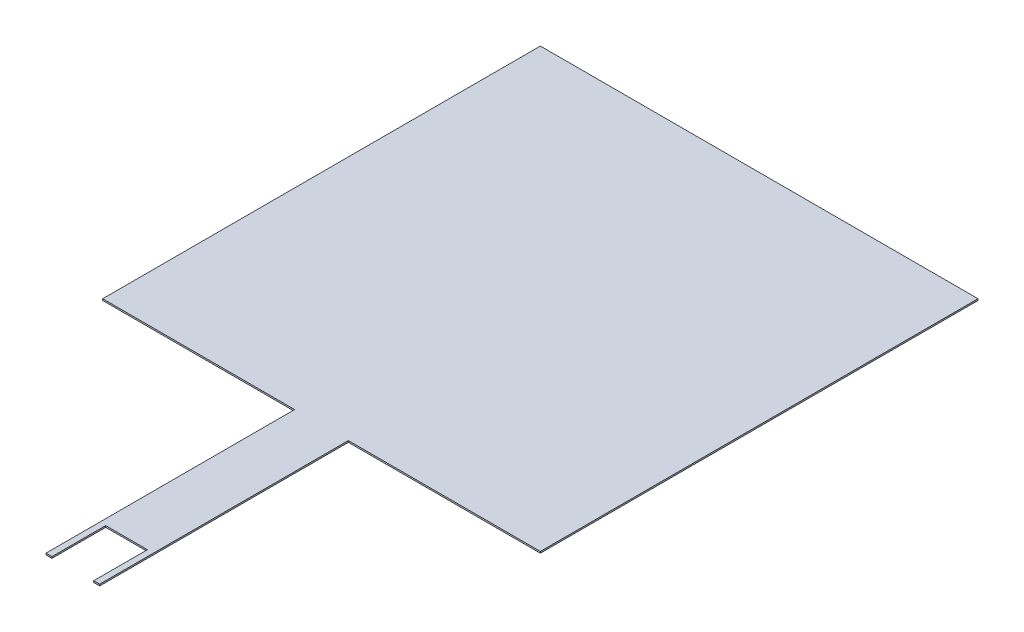
ISO-10303-21;
HEADER;
FILE_DESCRIPTION(('STEP AP214'),'2;1');
FILE_NAME('part.step','',(''),(''),'','','');
FILE_SCHEMA(('AUTOMOTIVE_DESIGN { 1 0 10303 214 1 1 1 1 }'));
ENDSEC;
DATA;
#1=APPLICATION_CONTEXT('core data for automotive mechanical design processes');
#2=APPLICATION_PROTOCOL_DEFINITION('international standard','automotive_design',2000,#1);
#3=PRODUCT_CONTEXT('',#1,'mechanical');
#4=PRODUCT('Part','Part','',(#3));
#5=PRODUCT_RELATED_PRODUCT_CATEGORY('part','',(#4));
#6=PRODUCT_DEFINITION_FORMATION('','',#4);
#7=PRODUCT_DEFINITION_CONTEXT('part definition',#1,'design');
#8=PRODUCT_DEFINITION('design','',#6,#7);
#9=PRODUCT_DEFINITION_SHAPE('','',#8);
#10=(LENGTH_UNIT() NAMED_UNIT(*) SI_UNIT(.MILLI.,.METRE.));
#11=(NAMED_UNIT(*) PLANE_ANGLE_UNIT() SI_UNIT($,.RADIAN.));
#12=(NAMED_UNIT(*) SI_UNIT($,.STERADIAN.) SOLID_ANGLE_UNIT());
#13=UNCERTAINTY_MEASURE_WITH_UNIT(LENGTH_MEASURE(1.E-05),#10,'distance_accuracy_value','');
#14=(GEOMETRIC_REPRESENTATION_CONTEXT(3) GLOBAL_UNCERTAINTY_ASSIGNED_CONTEXT((#13)) GLOBAL_UNIT_ASSIGNED_CONTEXT((#10,
#11,#12)) REPRESENTATION_CONTEXT('',''));
#15=CARTESIAN_POINT('',(0.,0.,0.));
#16=DIRECTION('',(0.,0.,1.));
#17=DIRECTION('',(1.,0.,0.));
#18=AXIS2_PLACEMENT_3D('',#15,#16,#17);
#19=CARTESIAN_POINT('',(27.94,0.2032,27.94));
#20=DIRECTION('',(-1.,0.,0.));
#21=DIRECTION('',(0.,0.,1.));
#22=AXIS2_PLACEMENT_3D('',#19,#20,#21);
#23=PLANE('',#22);
#24=DIRECTION('',(0.,0.,-1.));
#25=VECTOR('',#24,1.);
#26=CARTESIAN_POINT('',(27.94,0.,27.94));
#27=LINE('',#26,#25);
#28=CARTESIAN_POINT('',(27.94,0.,27.94));
#29=VERTEX_POINT('',#28);
#30=CARTESIAN_POINT('',(27.94,0.,-27.94));
#31=VERTEX_POINT('',#30);
#32=EDGE_CURVE('E165',#29,#31,#27,.T.);
#33=ORIENTED_EDGE('',*,*,#32,.T.);
#34=DIRECTION('',(0.,-1.,0.));
#35=VECTOR('',#34,1.);
#36=CARTESIAN_POINT('',(27.94,0.2032,-27.94));
#37=LINE('',#36,#35);
#38=CARTESIAN_POINT('',(27.94,0.2032,-27.94));
#39=VERTEX_POINT('',#38);
#40=EDGE_CURVE('E11',#39,#31,#37,.T.);
#41=ORIENTED_EDGE('',*,*,#40,.F.);
#42=DIRECTION('',(0.,0.,-1.));
#43=VECTOR('',#42,1.);
#44=CARTESIAN_POINT('',(27.94,0.2032,27.94));
#45=LINE('',#44,#43);
#46=CARTESIAN_POINT('',(27.94,0.2032,27.94));
#47=VERTEX_POINT('',#46);
#48=EDGE_CURVE('E188',#47,#39,#45,.T.);
#49=ORIENTED_EDGE('',*,*,#48,.F.);
#50=DIRECTION('',(0.,-1.,0.));
#51=VECTOR('',#50,1.);
#52=CARTESIAN_POINT('',(27.94,0.2032,27.94));
#53=LINE('',#52,#51);
#54=EDGE_CURVE('E161',#47,#29,#53,.T.);
#55=ORIENTED_EDGE('',*,*,#54,.T.);
#56=EDGE_LOOP('',(#33,#41,#49,#55));
#57=FACE_BOUND('',#56,.T.);
#58=ADVANCED_FACE('F45',(#57),#23,.F.);
#59=CARTESIAN_POINT('',(-27.94,0.2032,-27.94));
#60=DIRECTION('',(0.,0.,1.));
#61=DIRECTION('',(1.,0.,0.));
#62=AXIS2_PLACEMENT_3D('',#59,#60,#61);
#63=PLANE('',#62);
#64=DIRECTION('',(-1.,0.,0.));
#65=VECTOR('',#64,1.);
#66=CARTESIAN_POINT('',(-27.94,0.,-27.94));
#67=LINE('',#66,#65);
#68=CARTESIAN_POINT('',(-27.94,0.,-27.94));
#69=VERTEX_POINT('',#68);
#70=EDGE_CURVE('E168',#31,#69,#67,.T.);
#71=ORIENTED_EDGE('',*,*,#70,.T.);
#72=DIRECTION('',(0.,-1.,0.));
#73=VECTOR('',#72,1.);
#74=CARTESIAN_POINT('',(-27.94,0.2032,-27.94));
#75=LINE('',#74,#73);
#76=CARTESIAN_POINT('',(-27.94,0.2032,-27.94));
#77=VERTEX_POINT('',#76);
#78=EDGE_CURVE('E53',#77,#69,#75,.T.);
#79=ORIENTED_EDGE('',*,*,#78,.F.);
#80=DIRECTION('',(-1.,0.,0.));
#81=VECTOR('',#80,1.);
#82=CARTESIAN_POINT('',(-27.94,0.2032,-27.94));
#83=LINE('',#82,#81);
#84=EDGE_CURVE('E115',#39,#77,#83,.T.);
#85=ORIENTED_EDGE('',*,*,#84,.F.);
#86=ORIENTED_EDGE('',*,*,#40,.T.);
#87=EDGE_LOOP('',(#71,#79,#85,#86));
#88=FACE_BOUND('',#87,.T.);
#89=ADVANCED_FACE('F265',(#88),#63,.F.);
#90=CARTESIAN_POINT('',(-27.94,0.2032,27.94));
#91=DIRECTION('',(1.,0.,0.));
#92=DIRECTION('',(0.,0.,-1.));
#93=AXIS2_PLACEMENT_3D('',#90,#91,#92);
#94=PLANE('',#93);
#95=DIRECTION('',(0.,0.,1.));
#96=VECTOR('',#95,1.);
#97=CARTESIAN_POINT('',(-27.94,0.,27.94));
#98=LINE('',#97,#96);
#99=CARTESIAN_POINT('',(-27.94,0.,27.94));
#100=VERTEX_POINT('',#99);
#101=EDGE_CURVE('E170',#69,#100,#98,.T.);
#102=ORIENTED_EDGE('',*,*,#101,.T.);
#103=DIRECTION('',(0.,-1.,0.));
#104=VECTOR('',#103,1.);
#105=CARTESIAN_POINT('',(-27.94,0.2032,27.94));
#106=LINE('',#105,#104);
#107=CARTESIAN_POINT('',(-27.94,0.2032,27.94));
#108=VERTEX_POINT('',#107);
#109=EDGE_CURVE('E207',#108,#100,#106,.T.);
#110=ORIENTED_EDGE('',*,*,#109,.F.);
#111=DIRECTION('',(0.,0.,1.));
#112=VECTOR('',#111,1.);
#113=CARTESIAN_POINT('',(-27.94,0.2032,27.94));
#114=LINE('',#113,#112);
#115=EDGE_CURVE('E215',#77,#108,#114,.T.);
#116=ORIENTED_EDGE('',*,*,#115,.F.);
#117=ORIENTED_EDGE('',*,*,#78,.T.);
#118=EDGE_LOOP('',(#102,#110,#116,#117));
#119=FACE_BOUND('',#118,.T.);
#120=ADVANCED_FACE('F213',(#119),#94,.F.);
#121=CARTESIAN_POINT('',(-27.94,0.2032,27.94));
#122=DIRECTION('',(0.,0.,-1.));
#123=DIRECTION('',(-1.,0.,0.));
#124=AXIS2_PLACEMENT_3D('',#121,#122,#123);
#125=PLANE('',#124);
#126=DIRECTION('',(1.,0.,0.));
#127=VECTOR('',#126,1.);
#128=CARTESIAN_POINT('',(-27.94,0.,27.94));
#129=LINE('',#128,#127);
#130=CARTESIAN_POINT('',(-3.429,0.,27.94));
#131=VERTEX_POINT('',#130);
#132=EDGE_CURVE('E172',#100,#131,#129,.T.);
#133=ORIENTED_EDGE('',*,*,#132,.T.);
#134=DIRECTION('',(0.,-1.,0.));
#135=VECTOR('',#134,1.);
#136=CARTESIAN_POINT('',(-3.429,0.2032,27.94));
#137=LINE('',#136,#135);
#138=CARTESIAN_POINT('',(-3.429,0.2032,27.94));
#139=VERTEX_POINT('',#138);
#140=EDGE_CURVE('E204',#139,#131,#137,.T.);
#141=ORIENTED_EDGE('',*,*,#140,.F.);
#142=DIRECTION('',(1.,0.,0.));
#143=VECTOR('',#142,1.);
#144=CARTESIAN_POINT('',(-27.94,0.2032,27.94));
#145=LINE('',#144,#143);
#146=EDGE_CURVE('E232',#108,#139,#145,.T.);
#147=ORIENTED_EDGE('',*,*,#146,.F.);
#148=ORIENTED_EDGE('',*,*,#109,.T.);
#149=EDGE_LOOP('',(#133,#141,#147,#148));
#150=FACE_BOUND('',#149,.T.);
#151=ADVANCED_FACE('F223',(#150),#125,.F.);
#152=CARTESIAN_POINT('',(-3.429,0.2032,52.832));
#153=DIRECTION('',(1.,0.,0.));
#154=DIRECTION('',(0.,0.,-1.));
#155=AXIS2_PLACEMENT_3D('',#152,#153,#154);
#156=PLANE('',#155);
#157=DIRECTION('',(0.,0.,1.));
#158=VECTOR('',#157,1.);
#159=CARTESIAN_POINT('',(-3.429,0.,52.832));
#160=LINE('',#159,#158);
#161=CARTESIAN_POINT('',(-3.429,0.,59.69));
#162=VERTEX_POINT('',#161);
#163=EDGE_CURVE('E175',#131,#162,#160,.T.);
#164=ORIENTED_EDGE('',*,*,#163,.T.);
#165=DIRECTION('',(0.,-1.,0.));
#166=VECTOR('',#165,1.);
#167=CARTESIAN_POINT('',(-3.429,0.2032,59.69));
#168=LINE('',#167,#166);
#169=CARTESIAN_POINT('',(-3.429,0.2032,59.69));
#170=VERTEX_POINT('',#169);
#171=EDGE_CURVE('E201',#170,#162,#168,.T.);
#172=ORIENTED_EDGE('',*,*,#171,.F.);
#173=DIRECTION('',(0.,0.,1.));
#174=VECTOR('',#173,1.);
#175=CARTESIAN_POINT('',(-3.429,0.2032,52.832));
#176=LINE('',#175,#174);
#177=EDGE_CURVE('E229',#139,#170,#176,.T.);
#178=ORIENTED_EDGE('',*,*,#177,.F.);
#179=ORIENTED_EDGE('',*,*,#140,.T.);
#180=EDGE_LOOP('',(#164,#172,#178,#179));
#181=FACE_BOUND('',#180,.T.);
#182=ADVANCED_FACE('F227',(#181),#156,.F.);
#183=CARTESIAN_POINT('',(-3.429,0.2032,59.69));
#184=DIRECTION('',(0.,0.,-1.));
#185=DIRECTION('',(-1.,0.,0.));
#186=AXIS2_PLACEMENT_3D('',#183,#184,#185);
#187=PLANE('',#186);
#188=DIRECTION('',(1.,0.,0.));
#189=VECTOR('',#188,1.);
#190=CARTESIAN_POINT('',(-3.429,0.,59.69));
#191=LINE('',#190,#189);
#192=CARTESIAN_POINT('',(-2.667,0.,59.69));
#193=VERTEX_POINT('',#192);
#194=EDGE_CURVE('E177',#162,#193,#191,.T.);
#195=ORIENTED_EDGE('',*,*,#194,.T.);
#196=DIRECTION('',(0.,-1.,0.));
#197=VECTOR('',#196,1.);
#198=CARTESIAN_POINT('',(-2.667,0.2032,59.69));
#199=LINE('',#198,#197);
#200=CARTESIAN_POINT('',(-2.667,0.2032,59.69));
#201=VERTEX_POINT('',#200);
#202=EDGE_CURVE('E198',#201,#193,#199,.T.);
#203=ORIENTED_EDGE('',*,*,#202,.F.);
#204=DIRECTION('',(1.,0.,0.));
#205=VECTOR('',#204,1.);
#206=CARTESIAN_POINT('',(-3.429,0.2032,59.69));
#207=LINE('',#206,#205);
#208=EDGE_CURVE('E231',#170,#201,#207,.T.);
#209=ORIENTED_EDGE('',*,*,#208,.F.);
#210=ORIENTED_EDGE('',*,*,#171,.T.);
#211=EDGE_LOOP('',(#195,#203,#209,#210));
#212=FACE_BOUND('',#211,.T.);
#213=ADVANCED_FACE('F278',(#212),#187,.F.);
#214=CARTESIAN_POINT('',(-2.667,0.2032,52.832));
#215=DIRECTION('',(-1.,0.,0.));
#216=DIRECTION('',(0.,0.,1.));
#217=AXIS2_PLACEMENT_3D('',#214,#215,#216);
#218=PLANE('',#217);
#219=DIRECTION('',(0.,0.,-1.));
#220=VECTOR('',#219,1.);
#221=CARTESIAN_POINT('',(-2.667,0.,52.832));
#222=LINE('',#221,#220);
#223=CARTESIAN_POINT('',(-2.667,0.,52.832));
#224=VERTEX_POINT('',#223);
#225=EDGE_CURVE('E179',#193,#224,#222,.T.);
#226=ORIENTED_EDGE('',*,*,#225,.T.);
#227=DIRECTION('',(0.,-1.,0.));
#228=VECTOR('',#227,1.);
#229=CARTESIAN_POINT('',(-2.667,0.2032,52.832));
#230=LINE('',#229,#228);
#231=CARTESIAN_POINT('',(-2.667,0.2032,52.832));
#232=VERTEX_POINT('',#231);
#233=EDGE_CURVE('E195',#232,#224,#230,.T.);
#234=ORIENTED_EDGE('',*,*,#233,.F.);
#235=DIRECTION('',(0.,0.,-1.));
#236=VECTOR('',#235,1.);
#237=CARTESIAN_POINT('',(-2.667,0.2032,52.832));
#238=LINE('',#237,#236);
#239=EDGE_CURVE('E234',#201,#232,#238,.T.);
#240=ORIENTED_EDGE('',*,*,#239,.F.);
#241=ORIENTED_EDGE('',*,*,#202,.T.);
#242=EDGE_LOOP('',(#226,#234,#240,#241));
#243=FACE_BOUND('',#242,.T.);
#244=ADVANCED_FACE('F281',(#243),#218,.F.);
#245=CARTESIAN_POINT('',(-2.667,0.2032,52.832));
#246=DIRECTION('',(0.,0.,-1.));
#247=DIRECTION('',(-1.,0.,0.));
#248=AXIS2_PLACEMENT_3D('',#245,#246,#247);
#249=PLANE('',#248);
#250=DIRECTION('',(1.,0.,0.));
#251=VECTOR('',#250,1.);
#252=CARTESIAN_POINT('',(-2.667,0.,52.832));
#253=LINE('',#252,#251);
#254=CARTESIAN_POINT('',(2.667,0.,52.832));
#255=VERTEX_POINT('',#254);
#256=EDGE_CURVE('E181',#224,#255,#253,.T.);
#257=ORIENTED_EDGE('',*,*,#256,.T.);
#258=DIRECTION('',(0.,-1.,0.));
#259=VECTOR('',#258,1.);
#260=CARTESIAN_POINT('',(2.667,0.2032,52.832));
#261=LINE('',#260,#259);
#262=CARTESIAN_POINT('',(2.667,0.2032,52.832));
#263=VERTEX_POINT('',#262);
#264=EDGE_CURVE('E192',#263,#255,#261,.T.);
#265=ORIENTED_EDGE('',*,*,#264,.F.);
#266=DIRECTION('',(1.,0.,0.));
#267=VECTOR('',#266,1.);
#268=CARTESIAN_POINT('',(-2.667,0.2032,52.832));
#269=LINE('',#268,#267);
#270=EDGE_CURVE('E240',#232,#263,#269,.T.);
#271=ORIENTED_EDGE('',*,*,#270,.F.);
#272=ORIENTED_EDGE('',*,*,#233,.T.);
#273=EDGE_LOOP('',(#257,#265,#271,#272));
#274=FACE_BOUND('',#273,.T.);
#275=ADVANCED_FACE('F246',(#274),#249,.F.);
#276=CARTESIAN_POINT('',(2.667,0.2032,52.832));
#277=DIRECTION('',(1.,0.,0.));
#278=DIRECTION('',(0.,0.,-1.));
#279=AXIS2_PLACEMENT_3D('',#276,#277,#278);
#280=PLANE('',#279);
#281=DIRECTION('',(0.,0.,1.));
#282=VECTOR('',#281,1.);
#283=CARTESIAN_POINT('',(2.667,0.,52.832));
#284=LINE('',#283,#282);
#285=CARTESIAN_POINT('',(2.667,0.,59.69));
#286=VERTEX_POINT('',#285);
#287=EDGE_CURVE('E183',#255,#286,#284,.T.);
#288=ORIENTED_EDGE('',*,*,#287,.T.);
#289=DIRECTION('',(0.,-1.,0.));
#290=VECTOR('',#289,1.);
#291=CARTESIAN_POINT('',(2.667,0.2032,59.69));
#292=LINE('',#291,#290);
#293=CARTESIAN_POINT('',(2.667,0.2032,59.69));
#294=VERTEX_POINT('',#293);
#295=EDGE_CURVE('E156',#294,#286,#292,.T.);
#296=ORIENTED_EDGE('',*,*,#295,.F.);
#297=DIRECTION('',(0.,0.,1.));
#298=VECTOR('',#297,1.);
#299=CARTESIAN_POINT('',(2.667,0.2032,52.832));
#300=LINE('',#299,#298);
#301=EDGE_CURVE('E146',#263,#294,#300,.T.);
#302=ORIENTED_EDGE('',*,*,#301,.F.);
#303=ORIENTED_EDGE('',*,*,#264,.T.);
#304=EDGE_LOOP('',(#288,#296,#302,#303));
#305=FACE_BOUND('',#304,.T.);
#306=ADVANCED_FACE('F250',(#305),#280,.F.);
#307=CARTESIAN_POINT('',(3.429,0.2032,59.69));
#308=DIRECTION('',(0.,0.,-1.));
#309=DIRECTION('',(-1.,0.,0.));
#310=AXIS2_PLACEMENT_3D('',#307,#308,#309);
#311=PLANE('',#310);
#312=DIRECTION('',(1.,0.,0.));
#313=VECTOR('',#312,1.);
#314=CARTESIAN_POINT('',(3.429,0.,59.69));
#315=LINE('',#314,#313);
#316=CARTESIAN_POINT('',(3.429,0.,59.69));
#317=VERTEX_POINT('',#316);
#318=EDGE_CURVE('E155',#286,#317,#315,.T.);
#319=ORIENTED_EDGE('',*,*,#318,.T.);
#320=DIRECTION('',(0.,-1.,0.));
#321=VECTOR('',#320,1.);
#322=CARTESIAN_POINT('',(3.429,0.2032,59.69));
#323=LINE('',#322,#321);
#324=CARTESIAN_POINT('',(3.429,0.2032,59.69));
#325=VERTEX_POINT('',#324);
#326=EDGE_CURVE('E152',#325,#317,#323,.T.);
#327=ORIENTED_EDGE('',*,*,#326,.F.);
#328=DIRECTION('',(1.,0.,0.));
#329=VECTOR('',#328,1.);
#330=CARTESIAN_POINT('',(3.429,0.2032,59.69));
#331=LINE('',#330,#329);
#332=EDGE_CURVE('E140',#294,#325,#331,.T.);
#333=ORIENTED_EDGE('',*,*,#332,.F.);
#334=ORIENTED_EDGE('',*,*,#295,.T.);
#335=EDGE_LOOP('',(#319,#327,#333,#334));
#336=FACE_BOUND('',#335,.T.);
#337=ADVANCED_FACE('F153',(#336),#311,.F.);
#338=CARTESIAN_POINT('',(3.429,0.2032,52.832));
#339=DIRECTION('',(-1.,0.,0.));
#340=DIRECTION('',(0.,0.,1.));
#341=AXIS2_PLACEMENT_3D('',#338,#339,#340);
#342=PLANE('',#341);
#343=DIRECTION('',(0.,0.,-1.));
#344=VECTOR('',#343,1.);
#345=CARTESIAN_POINT('',(3.429,0.,52.832));
#346=LINE('',#345,#344);
#347=CARTESIAN_POINT('',(3.429,0.,27.94));
#348=VERTEX_POINT('',#347);
#349=EDGE_CURVE('E101',#317,#348,#346,.T.);
#350=ORIENTED_EDGE('',*,*,#349,.T.);
#351=DIRECTION('',(0.,-1.,0.));
#352=VECTOR('',#351,1.);
#353=CARTESIAN_POINT('',(3.429,0.2032,27.94));
#354=LINE('',#353,#352);
#355=CARTESIAN_POINT('',(3.429,0.2032,27.94));
#356=VERTEX_POINT('',#355);
#357=EDGE_CURVE('E157',#356,#348,#354,.T.);
#358=ORIENTED_EDGE('',*,*,#357,.F.);
#359=DIRECTION('',(0.,0.,-1.));
#360=VECTOR('',#359,1.);
#361=CARTESIAN_POINT('',(3.429,0.2032,52.832));
#362=LINE('',#361,#360);
#363=EDGE_CURVE('E144',#325,#356,#362,.T.);
#364=ORIENTED_EDGE('',*,*,#363,.F.);
#365=ORIENTED_EDGE('',*,*,#326,.T.);
#366=EDGE_LOOP('',(#350,#358,#364,#365));
#367=FACE_BOUND('',#366,.T.);
#368=ADVANCED_FACE('F159',(#367),#342,.F.);
#369=CARTESIAN_POINT('',(3.429,0.2032,27.94));
#370=DIRECTION('',(0.,0.,-1.));
#371=DIRECTION('',(-1.,0.,0.));
#372=AXIS2_PLACEMENT_3D('',#369,#370,#371);
#373=PLANE('',#372);
#374=DIRECTION('',(1.,0.,0.));
#375=VECTOR('',#374,1.);
#376=CARTESIAN_POINT('',(3.429,0.,27.94));
#377=LINE('',#376,#375);
#378=EDGE_CURVE('E107',#348,#29,#377,.T.);
#379=ORIENTED_EDGE('',*,*,#378,.T.);
#380=ORIENTED_EDGE('',*,*,#54,.F.);
#381=DIRECTION('',(1.,0.,0.));
#382=VECTOR('',#381,1.);
#383=CARTESIAN_POINT('',(3.429,0.2032,27.94));
#384=LINE('',#383,#382);
#385=EDGE_CURVE('E61',#356,#47,#384,.T.);
#386=ORIENTED_EDGE('',*,*,#385,.F.);
#387=ORIENTED_EDGE('',*,*,#357,.T.);
#388=EDGE_LOOP('',(#379,#380,#386,#387));
#389=FACE_BOUND('',#388,.T.);
#390=ADVANCED_FACE('F254',(#389),#373,.F.);
#391=CARTESIAN_POINT('',(0.,0.2032,0.));
#392=DIRECTION('',(0.,-1.,0.));
#393=DIRECTION('',(0.,0.,-1.));
#394=AXIS2_PLACEMENT_3D('',#391,#392,#393);
#395=PLANE('',#394);
#396=ORIENTED_EDGE('',*,*,#48,.T.);
#397=ORIENTED_EDGE('',*,*,#84,.T.);
#398=ORIENTED_EDGE('',*,*,#115,.T.);
#399=ORIENTED_EDGE('',*,*,#146,.T.);
#400=ORIENTED_EDGE('',*,*,#177,.T.);
#401=ORIENTED_EDGE('',*,*,#208,.T.);
#402=ORIENTED_EDGE('',*,*,#239,.T.);
#403=ORIENTED_EDGE('',*,*,#270,.T.);
#404=ORIENTED_EDGE('',*,*,#301,.T.);
#405=ORIENTED_EDGE('',*,*,#332,.T.);
#406=ORIENTED_EDGE('',*,*,#363,.T.);
#407=ORIENTED_EDGE('',*,*,#385,.T.);
#408=EDGE_LOOP('',(#396,#397,#398,#399,#400,#401,#402,#403,#404,#405,#406,#407));
#409=FACE_BOUND('',#408,.T.);
#410=ADVANCED_FACE('F142',(#409),#395,.F.);
#411=CARTESIAN_POINT('',(0.,0.,0.));
#412=DIRECTION('',(0.,-1.,0.));
#413=DIRECTION('',(0.,0.,-1.));
#414=AXIS2_PLACEMENT_3D('',#411,#412,#413);
#415=PLANE('',#414);
#416=ORIENTED_EDGE('',*,*,#32,.F.);
#417=ORIENTED_EDGE('',*,*,#378,.F.);
#418=ORIENTED_EDGE('',*,*,#349,.F.);
#419=ORIENTED_EDGE('',*,*,#318,.F.);
#420=ORIENTED_EDGE('',*,*,#287,.F.);
#421=ORIENTED_EDGE('',*,*,#256,.F.);
#422=ORIENTED_EDGE('',*,*,#225,.F.);
#423=ORIENTED_EDGE('',*,*,#194,.F.);
#424=ORIENTED_EDGE('',*,*,#163,.F.);
#425=ORIENTED_EDGE('',*,*,#132,.F.);
#426=ORIENTED_EDGE('',*,*,#101,.F.);
#427=ORIENTED_EDGE('',*,*,#70,.F.);
#428=EDGE_LOOP('',(#416,#417,#418,#419,#420,#421,#422,#423,#424,#425,#426,#427));
#429=FACE_BOUND('',#428,.T.);
#430=ADVANCED_FACE('F219',(#429),#415,.T.);
#431=CLOSED_SHELL('',(#58,#89,#120,#151,#182,#213,#244,#275,#306,#337,#368,#390,#410,#430));
#432=MANIFOLD_SOLID_BREP('B2',#431);
#433=ADVANCED_BREP_SHAPE_REPRESENTATION('',(#18,#432),#14);
#434=SHAPE_DEFINITION_REPRESENTATION(#9,#433);
ENDSEC;
END-ISO-10303-21;
